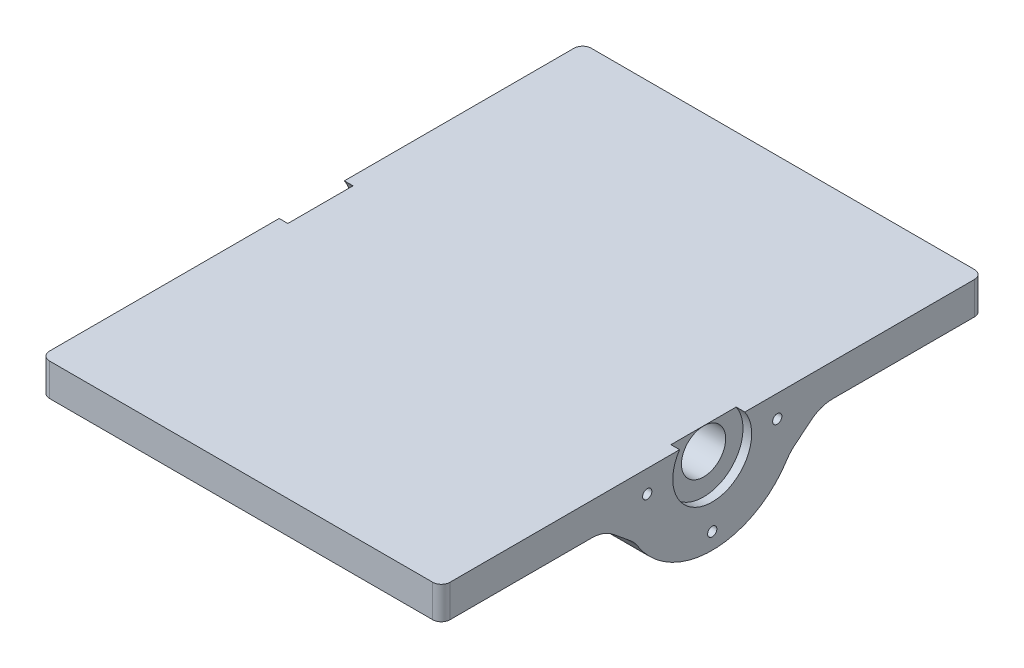
ISO-10303-21;
HEADER;
FILE_DESCRIPTION(('STEP AP214'),'2;1');
FILE_NAME('part.step','',(''),(''),'','','');
FILE_SCHEMA(('AUTOMOTIVE_DESIGN { 1 0 10303 214 1 1 1 1 }'));
ENDSEC;
DATA;
#1=APPLICATION_CONTEXT('core data for automotive mechanical design processes');
#2=APPLICATION_PROTOCOL_DEFINITION('international standard','automotive_design',2000,#1);
#3=PRODUCT_CONTEXT('',#1,'mechanical');
#4=PRODUCT('Part','Part','',(#3));
#5=PRODUCT_RELATED_PRODUCT_CATEGORY('part','',(#4));
#6=PRODUCT_DEFINITION_FORMATION('','',#4);
#7=PRODUCT_DEFINITION_CONTEXT('part definition',#1,'design');
#8=PRODUCT_DEFINITION('design','',#6,#7);
#9=PRODUCT_DEFINITION_SHAPE('','',#8);
#10=(LENGTH_UNIT() NAMED_UNIT(*) SI_UNIT(.MILLI.,.METRE.));
#11=(NAMED_UNIT(*) PLANE_ANGLE_UNIT() SI_UNIT($,.RADIAN.));
#12=(NAMED_UNIT(*) SI_UNIT($,.STERADIAN.) SOLID_ANGLE_UNIT());
#13=UNCERTAINTY_MEASURE_WITH_UNIT(LENGTH_MEASURE(1.E-05),#10,'distance_accuracy_value','');
#14=(GEOMETRIC_REPRESENTATION_CONTEXT(3) GLOBAL_UNCERTAINTY_ASSIGNED_CONTEXT((#13)) GLOBAL_UNIT_ASSIGNED_CONTEXT((#10,
#11,#12)) REPRESENTATION_CONTEXT('',''));
#15=CARTESIAN_POINT('',(0.,0.,0.));
#16=DIRECTION('',(0.,0.,1.));
#17=DIRECTION('',(1.,0.,0.));
#18=AXIS2_PLACEMENT_3D('',#15,#16,#17);
#19=CARTESIAN_POINT('',(-154.686,-6.50240000000002,79.375));
#20=DIRECTION('',(1.,0.,0.));
#21=DIRECTION('',(0.,1.,0.));
#22=AXIS2_PLACEMENT_3D('',#19,#20,#21);
#23=CYLINDRICAL_SURFACE('',#22,6.477);
#24=CARTESIAN_POINT('',(-2.53999999999999,-6.5024,79.375));
#25=DIRECTION('',(1.,0.,0.));
#26=DIRECTION('',(0.,1.,0.));
#27=AXIS2_PLACEMENT_3D('',#24,#25,#26);
#28=CIRCLE('',#27,6.477);
#29=CARTESIAN_POINT('',(-2.53999999999999,-0.0254000000000044,79.375));
#30=VERTEX_POINT('',#29);
#31=EDGE_CURVE('E395',#30,#30,#28,.F.);
#32=ORIENTED_EDGE('',*,*,#31,.F.);
#33=EDGE_LOOP('',(#32));
#34=FACE_BOUND('',#33,.T.);
#35=CARTESIAN_POINT('',(-114.808,-6.50240000000001,79.375));
#36=DIRECTION('',(-1.,0.,0.));
#37=DIRECTION('',(0.,0.,1.));
#38=AXIS2_PLACEMENT_3D('',#35,#36,#37);
#39=CIRCLE('',#38,6.477);
#40=CARTESIAN_POINT('',(-114.808,-6.50240000000001,85.852));
#41=VERTEX_POINT('',#40);
#42=EDGE_CURVE('E199',#41,#41,#39,.F.);
#43=ORIENTED_EDGE('',*,*,#42,.F.);
#44=EDGE_LOOP('',(#43));
#45=FACE_BOUND('',#44,.T.);
#46=ADVANCED_FACE('F50',(#34,#45),#23,.F.);
#47=CARTESIAN_POINT('',(0.,0.,158.75));
#48=DIRECTION('',(0.,-1.,0.));
#49=DIRECTION('',(0.,0.,-1.));
#50=AXIS2_PLACEMENT_3D('',#47,#48,#49);
#51=PLANE('',#50);
#52=DIRECTION('',(-1.,0.,0.));
#53=VECTOR('',#52,1.);
#54=CARTESIAN_POINT('',(0.,0.,158.75));
#55=LINE('',#54,#53);
#56=CARTESIAN_POINT('',(-2.54,0.,158.75));
#57=VERTEX_POINT('',#56);
#58=CARTESIAN_POINT('',(-114.808,0.,158.75));
#59=VERTEX_POINT('',#58);
#60=EDGE_CURVE('E368',#57,#59,#55,.T.);
#61=ORIENTED_EDGE('',*,*,#60,.F.);
#62=CARTESIAN_POINT('',(-2.54,0.,156.21));
#63=DIRECTION('',(0.,-1.,0.));
#64=DIRECTION('',(0.,0.,-1.));
#65=AXIS2_PLACEMENT_3D('',#62,#63,#64);
#66=CIRCLE('',#65,2.54);
#67=CARTESIAN_POINT('',(0.,0.,156.21));
#68=VERTEX_POINT('',#67);
#69=EDGE_CURVE('E317',#57,#68,#66,.F.);
#70=ORIENTED_EDGE('',*,*,#69,.T.);
#71=DIRECTION('',(0.,0.,-1.));
#72=VECTOR('',#71,1.);
#73=CARTESIAN_POINT('',(0.,0.,158.75));
#74=LINE('',#73,#72);
#75=CARTESIAN_POINT('',(0.,0.,88.9292159929531));
#76=VERTEX_POINT('',#75);
#77=EDGE_CURVE('E384',#68,#76,#74,.T.);
#78=ORIENTED_EDGE('',*,*,#77,.T.);
#79=DIRECTION('',(1.,0.,0.));
#80=VECTOR('',#79,1.);
#81=CARTESIAN_POINT('',(-2.54,0.,88.9292159929531));
#82=LINE('',#81,#80);
#83=CARTESIAN_POINT('',(-2.54,0.,88.9292159929531));
#84=VERTEX_POINT('',#83);
#85=EDGE_CURVE('E220',#76,#84,#82,.F.);
#86=ORIENTED_EDGE('',*,*,#85,.T.);
#87=DIRECTION('',(0.,0.,1.));
#88=VECTOR('',#87,1.);
#89=CARTESIAN_POINT('',(-2.54,0.,158.75));
#90=LINE('',#89,#88);
#91=CARTESIAN_POINT('',(-2.54,0.,69.8207840070469));
#92=VERTEX_POINT('',#91);
#93=EDGE_CURVE('E398',#92,#84,#90,.T.);
#94=ORIENTED_EDGE('',*,*,#93,.F.);
#95=DIRECTION('',(1.,0.,0.));
#96=VECTOR('',#95,1.);
#97=CARTESIAN_POINT('',(-2.54,0.,69.8207840070469));
#98=LINE('',#97,#96);
#99=CARTESIAN_POINT('',(0.,0.,69.8207840070469));
#100=VERTEX_POINT('',#99);
#101=EDGE_CURVE('E213',#92,#100,#98,.T.);
#102=ORIENTED_EDGE('',*,*,#101,.T.);
#103=CARTESIAN_POINT('',(0.,0.,2.54000000000004));
#104=VERTEX_POINT('',#103);
#105=EDGE_CURVE('E364',#100,#104,#74,.T.);
#106=ORIENTED_EDGE('',*,*,#105,.T.);
#107=CARTESIAN_POINT('',(-2.54,0.,2.53999999999999));
#108=DIRECTION('',(0.,-1.,0.));
#109=DIRECTION('',(0.,0.,-1.));
#110=AXIS2_PLACEMENT_3D('',#107,#108,#109);
#111=CIRCLE('',#110,2.54);
#112=CARTESIAN_POINT('',(-2.54,0.,0.));
#113=VERTEX_POINT('',#112);
#114=EDGE_CURVE('E308',#104,#113,#111,.F.);
#115=ORIENTED_EDGE('',*,*,#114,.T.);
#116=DIRECTION('',(-1.,0.,0.));
#117=VECTOR('',#116,1.);
#118=CARTESIAN_POINT('',(0.,0.,0.));
#119=LINE('',#118,#117);
#120=CARTESIAN_POINT('',(-114.808,0.,0.));
#121=VERTEX_POINT('',#120);
#122=EDGE_CURVE('E362',#113,#121,#119,.T.);
#123=ORIENTED_EDGE('',*,*,#122,.T.);
#124=CARTESIAN_POINT('',(-114.808,0.,2.53999999999999));
#125=DIRECTION('',(0.,-1.,0.));
#126=DIRECTION('',(0.,0.,-1.));
#127=AXIS2_PLACEMENT_3D('',#124,#125,#126);
#128=CIRCLE('',#127,2.54);
#129=CARTESIAN_POINT('',(-117.348,0.,2.54000000000004));
#130=VERTEX_POINT('',#129);
#131=EDGE_CURVE('E311',#121,#130,#128,.F.);
#132=ORIENTED_EDGE('',*,*,#131,.T.);
#133=DIRECTION('',(0.,0.,-1.));
#134=VECTOR('',#133,1.);
#135=CARTESIAN_POINT('',(-117.348,0.,158.75));
#136=LINE('',#135,#134);
#137=CARTESIAN_POINT('',(-117.348,0.,69.8207840070469));
#138=VERTEX_POINT('',#137);
#139=EDGE_CURVE('E374',#138,#130,#136,.T.);
#140=ORIENTED_EDGE('',*,*,#139,.F.);
#141=DIRECTION('',(-1.,0.,0.));
#142=VECTOR('',#141,1.);
#143=CARTESIAN_POINT('',(-114.808,0.,69.8207840070469));
#144=LINE('',#143,#142);
#145=CARTESIAN_POINT('',(-114.808,0.,69.8207840070469));
#146=VERTEX_POINT('',#145);
#147=EDGE_CURVE('E200',#146,#138,#144,.T.);
#148=ORIENTED_EDGE('',*,*,#147,.F.);
#149=DIRECTION('',(0.,0.,-1.));
#150=VECTOR('',#149,1.);
#151=CARTESIAN_POINT('',(-114.808,0.,158.75));
#152=LINE('',#151,#150);
#153=CARTESIAN_POINT('',(-114.808,0.,88.9292159929531));
#154=VERTEX_POINT('',#153);
#155=EDGE_CURVE('E205',#154,#146,#152,.T.);
#156=ORIENTED_EDGE('',*,*,#155,.F.);
#157=DIRECTION('',(-1.,0.,0.));
#158=VECTOR('',#157,1.);
#159=CARTESIAN_POINT('',(-114.808,0.,88.9292159929531));
#160=LINE('',#159,#158);
#161=CARTESIAN_POINT('',(-117.348,0.,88.9292159929531));
#162=VERTEX_POINT('',#161);
#163=EDGE_CURVE('E188',#162,#154,#160,.F.);
#164=ORIENTED_EDGE('',*,*,#163,.F.);
#165=CARTESIAN_POINT('',(-117.348,0.,156.21));
#166=VERTEX_POINT('',#165);
#167=EDGE_CURVE('E381',#166,#162,#136,.T.);
#168=ORIENTED_EDGE('',*,*,#167,.F.);
#169=CARTESIAN_POINT('',(-114.808,0.,156.21));
#170=DIRECTION('',(0.,-1.,0.));
#171=DIRECTION('',(0.,0.,-1.));
#172=AXIS2_PLACEMENT_3D('',#169,#170,#171);
#173=CIRCLE('',#172,2.54);
#174=EDGE_CURVE('E314',#166,#59,#173,.F.);
#175=ORIENTED_EDGE('',*,*,#174,.T.);
#176=EDGE_LOOP('',(#61,#70,#78,#86,#94,#102,#106,#115,#123,#132,#140,#148,#156,#164,#168,#175));
#177=FACE_BOUND('',#176,.T.);
#178=ADVANCED_FACE('F209',(#177),#51,.F.);
#179=CARTESIAN_POINT('',(0.,0.,158.75));
#180=DIRECTION('',(-1.,0.,0.));
#181=DIRECTION('',(0.,-1.,0.));
#182=AXIS2_PLACEMENT_3D('',#179,#180,#181);
#183=PLANE('',#182);
#184=CARTESIAN_POINT('',(0.,-6.5024,98.425));
#185=DIRECTION('',(1.,0.,0.));
#186=DIRECTION('',(0.,1.,0.));
#187=AXIS2_PLACEMENT_3D('',#184,#185,#186);
#188=CIRCLE('',#187,1.35255);
#189=CARTESIAN_POINT('',(0.,-5.14985,98.425));
#190=VERTEX_POINT('',#189);
#191=EDGE_CURVE('E391',#190,#190,#188,.T.);
#192=ORIENTED_EDGE('',*,*,#191,.F.);
#193=EDGE_LOOP('',(#192));
#194=FACE_BOUND('',#193,.T.);
#195=CARTESIAN_POINT('',(0.,-6.5024,60.325));
#196=DIRECTION('',(1.,0.,0.));
#197=DIRECTION('',(0.,1.,0.));
#198=AXIS2_PLACEMENT_3D('',#195,#196,#197);
#199=CIRCLE('',#198,1.35255);
#200=CARTESIAN_POINT('',(0.,-5.14985,60.325));
#201=VERTEX_POINT('',#200);
#202=EDGE_CURVE('E425',#201,#201,#199,.T.);
#203=ORIENTED_EDGE('',*,*,#202,.F.);
#204=EDGE_LOOP('',(#203));
#205=FACE_BOUND('',#204,.T.);
#206=CARTESIAN_POINT('',(0.,-25.5524,79.375));
#207=DIRECTION('',(1.,0.,0.));
#208=DIRECTION('',(0.,1.,0.));
#209=AXIS2_PLACEMENT_3D('',#206,#207,#208);
#210=CIRCLE('',#209,1.35255);
#211=CARTESIAN_POINT('',(0.,-24.19985,79.375));
#212=VERTEX_POINT('',#211);
#213=EDGE_CURVE('E421',#212,#212,#210,.T.);
#214=ORIENTED_EDGE('',*,*,#213,.F.);
#215=EDGE_LOOP('',(#214));
#216=FACE_BOUND('',#215,.T.);
#217=ORIENTED_EDGE('',*,*,#77,.F.);
#218=DIRECTION('',(0.,1.,0.));
#219=VECTOR('',#218,1.);
#220=CARTESIAN_POINT('',(0.,0.,156.21));
#221=LINE('',#220,#219);
#222=CARTESIAN_POINT('',(0.,-9.525,156.21));
#223=VERTEX_POINT('',#222);
#224=EDGE_CURVE('E324',#68,#223,#221,.F.);
#225=ORIENTED_EDGE('',*,*,#224,.T.);
#226=DIRECTION('',(0.,0.,1.));
#227=VECTOR('',#226,1.);
#228=CARTESIAN_POINT('',(0.,-9.525,158.75));
#229=LINE('',#228,#227);
#230=CARTESIAN_POINT('',(0.,-9.525,114.697404054283));
#231=VERTEX_POINT('',#230);
#232=EDGE_CURVE('E705',#231,#223,#229,.T.);
#233=ORIENTED_EDGE('',*,*,#232,.F.);
#234=CARTESIAN_POINT('',(0.,-19.525,114.697404054283));
#235=DIRECTION('',(-1.,0.,0.));
#236=DIRECTION('',(0.,-1.,0.));
#237=AXIS2_PLACEMENT_3D('',#234,#235,#236);
#238=CIRCLE('',#237,10.);
#239=CARTESIAN_POINT('',(0.,-11.7885396183789,108.36122375669));
#240=VERTEX_POINT('',#239);
#241=EDGE_CURVE('E275',#231,#240,#238,.T.);
#242=ORIENTED_EDGE('',*,*,#241,.T.);
#243=DIRECTION('',(0.,-0.633618029759311,-0.77364603816211));
#244=VECTOR('',#243,1.);
#245=CARTESIAN_POINT('',(0.,17.6446072030277,144.299022808391));
#246=LINE('',#245,#244);
#247=CARTESIAN_POINT('',(0.,-15.8476535429056,103.405055752203));
#248=VERTEX_POINT('',#247);
#249=EDGE_CURVE('E231',#240,#248,#246,.T.);
#250=ORIENTED_EDGE('',*,*,#249,.T.);
#251=CARTESIAN_POINT('',(0.,-23.5841139245267,109.741236049797));
#252=DIRECTION('',(-1.,0.,0.));
#253=DIRECTION('',(0.,-1.,0.));
#254=AXIS2_PLACEMENT_3D('',#251,#252,#253);
#255=CIRCLE('',#254,10.);
#256=CARTESIAN_POINT('',(0.,-18.2470161357175,101.284558972322));
#257=VERTEX_POINT('',#256);
#258=EDGE_CURVE('E284',#248,#257,#255,.T.);
#259=ORIENTED_EDGE('',*,*,#258,.T.);
#260=CARTESIAN_POINT('',(0.,-4.41966318447061,79.375));
#261=DIRECTION('',(-1.,0.,0.));
#262=DIRECTION('',(0.,1.,0.));
#263=AXIS2_PLACEMENT_3D('',#260,#261,#262);
#264=CIRCLE('',#263,25.908);
#265=CARTESIAN_POINT('',(0.,-18.2470161357176,57.4654410276783));
#266=VERTEX_POINT('',#265);
#267=EDGE_CURVE('E359',#266,#257,#264,.T.);
#268=ORIENTED_EDGE('',*,*,#267,.F.);
#269=CARTESIAN_POINT('',(0.,-23.5841139245268,49.0087639502035));
#270=DIRECTION('',(-1.,0.,0.));
#271=DIRECTION('',(0.,-1.,0.));
#272=AXIS2_PLACEMENT_3D('',#269,#270,#271);
#273=CIRCLE('',#272,10.);
#274=CARTESIAN_POINT('',(0.,-15.8476535429056,55.3449442477966));
#275=VERTEX_POINT('',#274);
#276=EDGE_CURVE('E287',#266,#275,#273,.T.);
#277=ORIENTED_EDGE('',*,*,#276,.T.);
#278=DIRECTION('',(0.,0.63361802975931,-0.773646038162111));
#279=VECTOR('',#278,1.);
#280=CARTESIAN_POINT('',(0.,-60.1740202479527,109.467327729383));
#281=LINE('',#280,#279);
#282=CARTESIAN_POINT('',(0.,-11.7885396183789,50.3887762433102));
#283=VERTEX_POINT('',#282);
#284=EDGE_CURVE('E239',#275,#283,#281,.T.);
#285=ORIENTED_EDGE('',*,*,#284,.T.);
#286=CARTESIAN_POINT('',(0.,-19.525,44.0525959457171));
#287=DIRECTION('',(-1.,0.,0.));
#288=DIRECTION('',(0.,-1.,0.));
#289=AXIS2_PLACEMENT_3D('',#286,#287,#288);
#290=CIRCLE('',#289,10.);
#291=CARTESIAN_POINT('',(0.,-9.525,44.0525959457171));
#292=VERTEX_POINT('',#291);
#293=EDGE_CURVE('E296',#283,#292,#290,.T.);
#294=ORIENTED_EDGE('',*,*,#293,.T.);
#295=DIRECTION('',(0.,0.,1.));
#296=VECTOR('',#295,1.);
#297=CARTESIAN_POINT('',(0.,-9.525,53.975));
#298=LINE('',#297,#296);
#299=CARTESIAN_POINT('',(0.,-9.525,2.53999999999999));
#300=VERTEX_POINT('',#299);
#301=EDGE_CURVE('E348',#300,#292,#298,.T.);
#302=ORIENTED_EDGE('',*,*,#301,.F.);
#303=DIRECTION('',(0.,1.,0.));
#304=VECTOR('',#303,1.);
#305=CARTESIAN_POINT('',(0.,0.,2.53999999999999));
#306=LINE('',#305,#304);
#307=EDGE_CURVE('E320',#300,#104,#306,.T.);
#308=ORIENTED_EDGE('',*,*,#307,.T.);
#309=ORIENTED_EDGE('',*,*,#105,.F.);
#310=CARTESIAN_POINT('',(0.,-6.5024,79.375));
#311=DIRECTION('',(1.,0.,0.));
#312=DIRECTION('',(0.,1.,0.));
#313=AXIS2_PLACEMENT_3D('',#310,#311,#312);
#314=CIRCLE('',#313,11.557);
#315=EDGE_CURVE('E409',#76,#100,#314,.T.);
#316=ORIENTED_EDGE('',*,*,#315,.F.);
#317=EDGE_LOOP('',(#217,#225,#233,#242,#250,#259,#268,#277,#285,#294,#302,#308,#309,#316));
#318=FACE_BOUND('',#317,.T.);
#319=ADVANCED_FACE('F353',(#194,#205,#216,#318),#183,.F.);
#320=CARTESIAN_POINT('',(-117.348,0.,158.75));
#321=DIRECTION('',(1.,0.,0.));
#322=DIRECTION('',(0.,0.,-1.));
#323=AXIS2_PLACEMENT_3D('',#320,#321,#322);
#324=PLANE('',#323);
#325=DIRECTION('',(0.,0.,1.));
#326=VECTOR('',#325,1.);
#327=CARTESIAN_POINT('',(-117.348,-9.52500000000001,158.75));
#328=LINE('',#327,#326);
#329=CARTESIAN_POINT('',(-117.348,-9.52500000000001,114.697404054283));
#330=VERTEX_POINT('',#329);
#331=CARTESIAN_POINT('',(-117.348,-9.52500000000001,156.21));
#332=VERTEX_POINT('',#331);
#333=EDGE_CURVE('E695',#330,#332,#328,.T.);
#334=ORIENTED_EDGE('',*,*,#333,.T.);
#335=DIRECTION('',(0.,-1.,0.));
#336=VECTOR('',#335,1.);
#337=CARTESIAN_POINT('',(-117.348,0.,156.21));
#338=LINE('',#337,#336);
#339=EDGE_CURVE('E337',#332,#166,#338,.F.);
#340=ORIENTED_EDGE('',*,*,#339,.T.);
#341=ORIENTED_EDGE('',*,*,#167,.T.);
#342=CARTESIAN_POINT('',(-117.348,-6.50240000000001,79.375));
#343=DIRECTION('',(1.,0.,0.));
#344=DIRECTION('',(0.,1.,0.));
#345=AXIS2_PLACEMENT_3D('',#342,#343,#344);
#346=CIRCLE('',#345,11.557);
#347=EDGE_CURVE('E194',#162,#138,#346,.T.);
#348=ORIENTED_EDGE('',*,*,#347,.T.);
#349=ORIENTED_EDGE('',*,*,#139,.T.);
#350=DIRECTION('',(0.,-1.,0.));
#351=VECTOR('',#350,1.);
#352=CARTESIAN_POINT('',(-117.348,-9.52500000000001,2.53999999999999));
#353=LINE('',#352,#351);
#354=CARTESIAN_POINT('',(-117.348,-9.52500000000001,2.53999999999999));
#355=VERTEX_POINT('',#354);
#356=EDGE_CURVE('E333',#130,#355,#353,.T.);
#357=ORIENTED_EDGE('',*,*,#356,.T.);
#358=DIRECTION('',(0.,0.,1.));
#359=VECTOR('',#358,1.);
#360=CARTESIAN_POINT('',(-117.348,-9.52500000000002,158.75));
#361=LINE('',#360,#359);
#362=CARTESIAN_POINT('',(-117.348,-9.52500000000001,44.0525959457171));
#363=VERTEX_POINT('',#362);
#364=EDGE_CURVE('E698',#355,#363,#361,.T.);
#365=ORIENTED_EDGE('',*,*,#364,.T.);
#366=CARTESIAN_POINT('',(-117.348,-19.525,44.0525959457171));
#367=DIRECTION('',(1.,0.,0.));
#368=DIRECTION('',(0.,0.,-1.));
#369=AXIS2_PLACEMENT_3D('',#366,#367,#368);
#370=CIRCLE('',#369,10.);
#371=CARTESIAN_POINT('',(-117.348,-11.7885396183789,50.3887762433102));
#372=VERTEX_POINT('',#371);
#373=EDGE_CURVE('E293',#363,#372,#370,.T.);
#374=ORIENTED_EDGE('',*,*,#373,.T.);
#375=DIRECTION('',(0.,-0.63361802975931,0.773646038162111));
#376=VECTOR('',#375,1.);
#377=CARTESIAN_POINT('',(-117.348,-60.1740202479527,109.467327729383));
#378=LINE('',#377,#376);
#379=CARTESIAN_POINT('',(-117.348,-15.8476535429057,55.3449442477966));
#380=VERTEX_POINT('',#379);
#381=EDGE_CURVE('E243',#372,#380,#378,.T.);
#382=ORIENTED_EDGE('',*,*,#381,.T.);
#383=CARTESIAN_POINT('',(-117.348,-23.5841139245268,49.0087639502035));
#384=DIRECTION('',(1.,0.,0.));
#385=DIRECTION('',(0.,0.,-1.));
#386=AXIS2_PLACEMENT_3D('',#383,#384,#385);
#387=CIRCLE('',#386,10.);
#388=CARTESIAN_POINT('',(-117.348,-18.2470161357176,57.4654410276783));
#389=VERTEX_POINT('',#388);
#390=EDGE_CURVE('E290',#380,#389,#387,.T.);
#391=ORIENTED_EDGE('',*,*,#390,.T.);
#392=CARTESIAN_POINT('',(-117.348,-4.41966318447063,79.375));
#393=DIRECTION('',(1.,0.,0.));
#394=DIRECTION('',(0.,0.,-1.));
#395=AXIS2_PLACEMENT_3D('',#392,#393,#394);
#396=CIRCLE('',#395,25.908);
#397=CARTESIAN_POINT('',(-117.348,-18.2470161357175,101.284558972322));
#398=VERTEX_POINT('',#397);
#399=EDGE_CURVE('E227',#389,#398,#396,.F.);
#400=ORIENTED_EDGE('',*,*,#399,.T.);
#401=CARTESIAN_POINT('',(-117.348,-23.5841139245267,109.741236049797));
#402=DIRECTION('',(1.,0.,0.));
#403=DIRECTION('',(0.,0.,-1.));
#404=AXIS2_PLACEMENT_3D('',#401,#402,#403);
#405=CIRCLE('',#404,10.);
#406=CARTESIAN_POINT('',(-117.348,-15.8476535429056,103.405055752203));
#407=VERTEX_POINT('',#406);
#408=EDGE_CURVE('E281',#398,#407,#405,.T.);
#409=ORIENTED_EDGE('',*,*,#408,.T.);
#410=DIRECTION('',(0.,0.633618029759311,0.77364603816211));
#411=VECTOR('',#410,1.);
#412=CARTESIAN_POINT('',(-117.348,17.6446072030277,144.299022808391));
#413=LINE('',#412,#411);
#414=CARTESIAN_POINT('',(-117.348,-11.7885396183789,108.36122375669));
#415=VERTEX_POINT('',#414);
#416=EDGE_CURVE('E235',#407,#415,#413,.T.);
#417=ORIENTED_EDGE('',*,*,#416,.T.);
#418=CARTESIAN_POINT('',(-117.348,-19.525,114.697404054283));
#419=DIRECTION('',(1.,0.,0.));
#420=DIRECTION('',(0.,0.,-1.));
#421=AXIS2_PLACEMENT_3D('',#418,#419,#420);
#422=CIRCLE('',#421,10.);
#423=EDGE_CURVE('E278',#415,#330,#422,.T.);
#424=ORIENTED_EDGE('',*,*,#423,.T.);
#425=EDGE_LOOP('',(#334,#340,#341,#348,#349,#357,#365,#374,#382,#391,#400,#409,#417,#424));
#426=FACE_BOUND('',#425,.T.);
#427=CARTESIAN_POINT('',(-117.348,-6.50240000000002,98.425));
#428=DIRECTION('',(1.,0.,0.));
#429=DIRECTION('',(0.,0.,-1.));
#430=AXIS2_PLACEMENT_3D('',#427,#428,#429);
#431=CIRCLE('',#430,1.35255);
#432=CARTESIAN_POINT('',(-117.348,-5.14985000000002,98.425));
#433=VERTEX_POINT('',#432);
#434=EDGE_CURVE('E369',#433,#433,#431,.T.);
#435=ORIENTED_EDGE('',*,*,#434,.T.);
#436=EDGE_LOOP('',(#435));
#437=FACE_BOUND('',#436,.T.);
#438=CARTESIAN_POINT('',(-117.348,-6.50240000000001,60.325));
#439=DIRECTION('',(1.,0.,0.));
#440=DIRECTION('',(0.,0.,-1.));
#441=AXIS2_PLACEMENT_3D('',#438,#439,#440);
#442=CIRCLE('',#441,1.35255);
#443=CARTESIAN_POINT('',(-117.348,-5.14985000000001,60.325));
#444=VERTEX_POINT('',#443);
#445=EDGE_CURVE('E377',#444,#444,#442,.T.);
#446=ORIENTED_EDGE('',*,*,#445,.T.);
#447=EDGE_LOOP('',(#446));
#448=FACE_BOUND('',#447,.T.);
#449=CARTESIAN_POINT('',(-117.348,-25.5524,79.375));
#450=DIRECTION('',(1.,0.,0.));
#451=DIRECTION('',(0.,0.,-1.));
#452=AXIS2_PLACEMENT_3D('',#449,#450,#451);
#453=CIRCLE('',#452,1.35255);
#454=CARTESIAN_POINT('',(-117.348,-24.19985,79.375));
#455=VERTEX_POINT('',#454);
#456=EDGE_CURVE('E387',#455,#455,#453,.T.);
#457=ORIENTED_EDGE('',*,*,#456,.T.);
#458=EDGE_LOOP('',(#457));
#459=FACE_BOUND('',#458,.T.);
#460=ADVANCED_FACE('F436',(#426,#437,#448,#459),#324,.F.);
#461=CARTESIAN_POINT('',(0.,0.,158.75));
#462=DIRECTION('',(0.,0.,-1.));
#463=DIRECTION('',(-1.,0.,0.));
#464=AXIS2_PLACEMENT_3D('',#461,#462,#463);
#465=PLANE('',#464);
#466=DIRECTION('',(1.,0.,0.));
#467=VECTOR('',#466,1.);
#468=CARTESIAN_POINT('',(0.,-9.525,158.75));
#469=LINE('',#468,#467);
#470=CARTESIAN_POINT('',(-114.808,-9.52500000000001,158.75));
#471=VERTEX_POINT('',#470);
#472=CARTESIAN_POINT('',(-2.54,-9.525,158.75));
#473=VERTEX_POINT('',#472);
#474=EDGE_CURVE('E217',#471,#473,#469,.T.);
#475=ORIENTED_EDGE('',*,*,#474,.T.);
#476=DIRECTION('',(0.,1.,0.));
#477=VECTOR('',#476,1.);
#478=CARTESIAN_POINT('',(-2.54,0.,158.75));
#479=LINE('',#478,#477);
#480=EDGE_CURVE('E304',#473,#57,#479,.T.);
#481=ORIENTED_EDGE('',*,*,#480,.T.);
#482=ORIENTED_EDGE('',*,*,#60,.T.);
#483=DIRECTION('',(0.,-1.,0.));
#484=VECTOR('',#483,1.);
#485=CARTESIAN_POINT('',(-114.808,0.,158.75));
#486=LINE('',#485,#484);
#487=EDGE_CURVE('E300',#59,#471,#486,.T.);
#488=ORIENTED_EDGE('',*,*,#487,.T.);
#489=EDGE_LOOP('',(#475,#481,#482,#488));
#490=FACE_BOUND('',#489,.T.);
#491=ADVANCED_FACE('F443',(#490),#465,.F.);
#492=CARTESIAN_POINT('',(0.,0.,0.));
#493=DIRECTION('',(0.,0.,-1.));
#494=DIRECTION('',(-1.,0.,0.));
#495=AXIS2_PLACEMENT_3D('',#492,#493,#494);
#496=PLANE('',#495);
#497=DIRECTION('',(1.,0.,0.));
#498=VECTOR('',#497,1.);
#499=CARTESIAN_POINT('',(0.,-9.525,0.));
#500=LINE('',#499,#498);
#501=CARTESIAN_POINT('',(-114.808,-9.52500000000001,0.));
#502=VERTEX_POINT('',#501);
#503=CARTESIAN_POINT('',(-2.54,-9.525,0.));
#504=VERTEX_POINT('',#503);
#505=EDGE_CURVE('E212',#502,#504,#500,.T.);
#506=ORIENTED_EDGE('',*,*,#505,.F.);
#507=DIRECTION('',(0.,-1.,0.));
#508=VECTOR('',#507,1.);
#509=CARTESIAN_POINT('',(-114.808,0.,0.));
#510=LINE('',#509,#508);
#511=EDGE_CURVE('E12',#502,#121,#510,.F.);
#512=ORIENTED_EDGE('',*,*,#511,.T.);
#513=ORIENTED_EDGE('',*,*,#122,.F.);
#514=DIRECTION('',(0.,1.,0.));
#515=VECTOR('',#514,1.);
#516=CARTESIAN_POINT('',(-2.54,-9.525,0.));
#517=LINE('',#516,#515);
#518=EDGE_CURVE('E59',#113,#504,#517,.F.);
#519=ORIENTED_EDGE('',*,*,#518,.T.);
#520=EDGE_LOOP('',(#506,#512,#513,#519));
#521=FACE_BOUND('',#520,.T.);
#522=ADVANCED_FACE('F365',(#521),#496,.T.);
#523=CARTESIAN_POINT('',(-152.4,-25.5524,79.375));
#524=DIRECTION('',(1.,0.,0.));
#525=DIRECTION('',(0.,1.,0.));
#526=AXIS2_PLACEMENT_3D('',#523,#524,#525);
#527=CYLINDRICAL_SURFACE('',#526,1.35255);
#528=CARTESIAN_POINT('',(0.,-24.19985,79.375));
#529=CARTESIAN_POINT('',(-1.222375,-24.19985,79.375));
#530=CARTESIAN_POINT('',(-2.44475,-24.19985,79.375));
#531=CARTESIAN_POINT('',(-4.8895,-24.19985,79.375));
#532=CARTESIAN_POINT('',(-6.11187500000001,-24.19985,79.375));
#533=CARTESIAN_POINT('',(-8.55662500000001,-24.19985,79.375));
#534=CARTESIAN_POINT('',(-9.77900000000001,-24.19985,79.375));
#535=CARTESIAN_POINT('',(-12.22375,-24.19985,79.375));
#536=CARTESIAN_POINT('',(-13.446125,-24.19985,79.375));
#537=CARTESIAN_POINT('',(-15.890875,-24.19985,79.375));
#538=CARTESIAN_POINT('',(-17.11325,-24.19985,79.375));
#539=CARTESIAN_POINT('',(-19.558,-24.19985,79.375));
#540=CARTESIAN_POINT('',(-20.780375,-24.19985,79.375));
#541=CARTESIAN_POINT('',(-23.225125,-24.19985,79.375));
#542=CARTESIAN_POINT('',(-24.4475,-24.19985,79.375));
#543=CARTESIAN_POINT('',(-26.89225,-24.19985,79.375));
#544=CARTESIAN_POINT('',(-28.114625,-24.19985,79.375));
#545=CARTESIAN_POINT('',(-30.559375,-24.19985,79.375));
#546=CARTESIAN_POINT('',(-31.78175,-24.19985,79.375));
#547=CARTESIAN_POINT('',(-34.2265,-24.19985,79.375));
#548=CARTESIAN_POINT('',(-35.448875,-24.19985,79.375));
#549=CARTESIAN_POINT('',(-37.893625,-24.19985,79.375));
#550=CARTESIAN_POINT('',(-39.116,-24.19985,79.375));
#551=CARTESIAN_POINT('',(-41.56075,-24.19985,79.375));
#552=CARTESIAN_POINT('',(-42.783125,-24.19985,79.375));
#553=CARTESIAN_POINT('',(-45.227875,-24.19985,79.375));
#554=CARTESIAN_POINT('',(-46.45025,-24.19985,79.375));
#555=CARTESIAN_POINT('',(-48.895,-24.19985,79.375));
#556=CARTESIAN_POINT('',(-50.117375,-24.19985,79.375));
#557=CARTESIAN_POINT('',(-52.562125,-24.19985,79.375));
#558=CARTESIAN_POINT('',(-53.7845,-24.19985,79.375));
#559=CARTESIAN_POINT('',(-56.22925,-24.19985,79.375));
#560=CARTESIAN_POINT('',(-57.451625,-24.19985,79.375));
#561=CARTESIAN_POINT('',(-59.896375,-24.19985,79.375));
#562=CARTESIAN_POINT('',(-61.11875,-24.19985,79.375));
#563=CARTESIAN_POINT('',(-63.5635,-24.19985,79.375));
#564=CARTESIAN_POINT('',(-64.785875,-24.19985,79.375));
#565=CARTESIAN_POINT('',(-67.230625,-24.19985,79.375));
#566=CARTESIAN_POINT('',(-68.453,-24.19985,79.375));
#567=CARTESIAN_POINT('',(-70.89775,-24.19985,79.375));
#568=CARTESIAN_POINT('',(-72.120125,-24.19985,79.375));
#569=CARTESIAN_POINT('',(-74.564875,-24.19985,79.375));
#570=CARTESIAN_POINT('',(-75.78725,-24.19985,79.375));
#571=CARTESIAN_POINT('',(-78.232,-24.19985,79.375));
#572=CARTESIAN_POINT('',(-79.454375,-24.19985,79.375));
#573=CARTESIAN_POINT('',(-81.899125,-24.19985,79.375));
#574=CARTESIAN_POINT('',(-83.1215,-24.19985,79.375));
#575=CARTESIAN_POINT('',(-85.56625,-24.19985,79.375));
#576=CARTESIAN_POINT('',(-86.788625,-24.19985,79.375));
#577=CARTESIAN_POINT('',(-89.233375,-24.19985,79.375));
#578=CARTESIAN_POINT('',(-90.45575,-24.19985,79.375));
#579=CARTESIAN_POINT('',(-92.9005,-24.19985,79.375));
#580=CARTESIAN_POINT('',(-94.122875,-24.19985,79.375));
#581=CARTESIAN_POINT('',(-96.567625,-24.19985,79.375));
#582=CARTESIAN_POINT('',(-97.79,-24.19985,79.375));
#583=CARTESIAN_POINT('',(-100.23475,-24.19985,79.375));
#584=CARTESIAN_POINT('',(-101.457125,-24.19985,79.375));
#585=CARTESIAN_POINT('',(-103.901875,-24.19985,79.375));
#586=CARTESIAN_POINT('',(-105.12425,-24.19985,79.375));
#587=CARTESIAN_POINT('',(-107.569,-24.19985,79.375));
#588=CARTESIAN_POINT('',(-108.791375,-24.19985,79.375));
#589=CARTESIAN_POINT('',(-111.236125,-24.19985,79.375));
#590=CARTESIAN_POINT('',(-112.4585,-24.19985,79.375));
#591=CARTESIAN_POINT('',(-114.90325,-24.19985,79.375));
#592=CARTESIAN_POINT('',(-116.125625,-24.19985,79.375));
#593=CARTESIAN_POINT('',(-117.348,-24.19985,79.375));
#594=B_SPLINE_CURVE_WITH_KNOTS('',3,(#528,#529,#530,#531,#532,#533,#534,#535,#536,#537,#538,
#539,#540,#541,#542,#543,#544,#545,#546,#547,#548,#549,#550,#551,#552,#553,#554,#555,#556,#557,
#558,#559,#560,#561,#562,#563,#564,#565,#566,#567,#568,#569,#570,#571,#572,#573,#574,#575,#576,
#577,#578,#579,#580,#581,#582,#583,#584,#585,#586,#587,#588,#589,#590,#591,#592,#593),
.UNSPECIFIED.,.F.,.F.,(4,2,2,2,2,2,2,2,2,2,2,2,2,2,2,2,2,2,2,2,2,2,2,2,2,2,2,2,2,2,2,2,4),(0.,
3.66712499999999,7.33425000000001,11.001375,14.6685,18.335625,22.00275,25.669875,29.337,
33.004125,36.67125,40.338375,44.0055,47.672625,51.33975,55.006875,58.674,62.341125,66.00825,
69.675375,73.3425,77.009625,80.67675,84.343875,88.011,91.678125,95.34525,99.012375,102.6795,
106.346625,110.01375,113.680875,117.348),.UNSPECIFIED.);
#595=EDGE_CURVE('BSEAM432',#212,#455,#594,.T.);
#596=ORIENTED_EDGE('',*,*,#213,.T.);
#597=ORIENTED_EDGE('',*,*,#456,.F.);
#598=ORIENTED_EDGE('',*,*,#595,.T.);
#599=ORIENTED_EDGE('',*,*,#595,.F.);
#600=EDGE_LOOP('',(#596,#598,#597,#599));
#601=FACE_BOUND('',#600,.T.);
#602=ADVANCED_FACE('F432',(#601),#527,.F.);
#603=CARTESIAN_POINT('',(-152.4,-6.50240000000002,60.325));
#604=DIRECTION('',(1.,0.,0.));
#605=DIRECTION('',(0.,1.,0.));
#606=AXIS2_PLACEMENT_3D('',#603,#604,#605);
#607=CYLINDRICAL_SURFACE('',#606,1.35255);
#608=CARTESIAN_POINT('',(0.,-5.14985,60.325));
#609=CARTESIAN_POINT('',(-1.222375,-5.14985,60.325));
#610=CARTESIAN_POINT('',(-2.44475,-5.14985,60.325));
#611=CARTESIAN_POINT('',(-4.8895,-5.14985,60.325));
#612=CARTESIAN_POINT('',(-6.11187500000001,-5.14985,60.325));
#613=CARTESIAN_POINT('',(-8.55662500000001,-5.14985,60.325));
#614=CARTESIAN_POINT('',(-9.77900000000001,-5.14985,60.325));
#615=CARTESIAN_POINT('',(-12.22375,-5.14985,60.325));
#616=CARTESIAN_POINT('',(-13.446125,-5.14985,60.325));
#617=CARTESIAN_POINT('',(-15.890875,-5.14985,60.325));
#618=CARTESIAN_POINT('',(-17.11325,-5.14985,60.325));
#619=CARTESIAN_POINT('',(-19.558,-5.14985,60.325));
#620=CARTESIAN_POINT('',(-20.780375,-5.14985,60.325));
#621=CARTESIAN_POINT('',(-23.225125,-5.14985,60.325));
#622=CARTESIAN_POINT('',(-24.4475,-5.14985,60.325));
#623=CARTESIAN_POINT('',(-26.89225,-5.14985,60.325));
#624=CARTESIAN_POINT('',(-28.114625,-5.14985,60.325));
#625=CARTESIAN_POINT('',(-30.559375,-5.14985,60.325));
#626=CARTESIAN_POINT('',(-31.78175,-5.14985,60.325));
#627=CARTESIAN_POINT('',(-34.2265,-5.14985,60.325));
#628=CARTESIAN_POINT('',(-35.448875,-5.14985,60.325));
#629=CARTESIAN_POINT('',(-37.893625,-5.14985,60.325));
#630=CARTESIAN_POINT('',(-39.116,-5.14985,60.325));
#631=CARTESIAN_POINT('',(-41.56075,-5.14985,60.325));
#632=CARTESIAN_POINT('',(-42.783125,-5.14985000000001,60.325));
#633=CARTESIAN_POINT('',(-45.227875,-5.14985000000001,60.325));
#634=CARTESIAN_POINT('',(-46.45025,-5.14985000000001,60.325));
#635=CARTESIAN_POINT('',(-48.895,-5.14985000000001,60.325));
#636=CARTESIAN_POINT('',(-50.117375,-5.14985000000001,60.325));
#637=CARTESIAN_POINT('',(-52.562125,-5.14985000000001,60.325));
#638=CARTESIAN_POINT('',(-53.7845,-5.14985000000001,60.325));
#639=CARTESIAN_POINT('',(-56.22925,-5.14985000000001,60.325));
#640=CARTESIAN_POINT('',(-57.451625,-5.14985000000001,60.325));
#641=CARTESIAN_POINT('',(-59.896375,-5.14985000000001,60.325));
#642=CARTESIAN_POINT('',(-61.11875,-5.14985000000001,60.325));
#643=CARTESIAN_POINT('',(-63.5635,-5.14985000000001,60.325));
#644=CARTESIAN_POINT('',(-64.785875,-5.14985000000001,60.325));
#645=CARTESIAN_POINT('',(-67.230625,-5.14985000000001,60.325));
#646=CARTESIAN_POINT('',(-68.453,-5.14985000000001,60.325));
#647=CARTESIAN_POINT('',(-70.89775,-5.14985000000001,60.325));
#648=CARTESIAN_POINT('',(-72.120125,-5.14985000000001,60.325));
#649=CARTESIAN_POINT('',(-74.564875,-5.14985000000001,60.325));
#650=CARTESIAN_POINT('',(-75.78725,-5.14985000000001,60.325));
#651=CARTESIAN_POINT('',(-78.232,-5.14985000000001,60.325));
#652=CARTESIAN_POINT('',(-79.454375,-5.14985000000001,60.325));
#653=CARTESIAN_POINT('',(-81.899125,-5.14985000000001,60.325));
#654=CARTESIAN_POINT('',(-83.1215,-5.14985000000001,60.325));
#655=CARTESIAN_POINT('',(-85.56625,-5.14985000000001,60.325));
#656=CARTESIAN_POINT('',(-86.788625,-5.14985000000001,60.325));
#657=CARTESIAN_POINT('',(-89.233375,-5.14985000000001,60.325));
#658=CARTESIAN_POINT('',(-90.45575,-5.14985000000001,60.325));
#659=CARTESIAN_POINT('',(-92.9005,-5.14985000000001,60.325));
#660=CARTESIAN_POINT('',(-94.122875,-5.14985000000001,60.325));
#661=CARTESIAN_POINT('',(-96.567625,-5.14985000000001,60.325));
#662=CARTESIAN_POINT('',(-97.79,-5.14985000000001,60.325));
#663=CARTESIAN_POINT('',(-100.23475,-5.14985000000001,60.325));
#664=CARTESIAN_POINT('',(-101.457125,-5.14985000000001,60.325));
#665=CARTESIAN_POINT('',(-103.901875,-5.14985000000001,60.325));
#666=CARTESIAN_POINT('',(-105.12425,-5.14985000000001,60.325));
#667=CARTESIAN_POINT('',(-107.569,-5.14985000000001,60.325));
#668=CARTESIAN_POINT('',(-108.791375,-5.14985000000001,60.325));
#669=CARTESIAN_POINT('',(-111.236125,-5.14985000000001,60.325));
#670=CARTESIAN_POINT('',(-112.4585,-5.14985000000001,60.325));
#671=CARTESIAN_POINT('',(-114.90325,-5.14985000000001,60.325));
#672=CARTESIAN_POINT('',(-116.125625,-5.14985000000001,60.325));
#673=CARTESIAN_POINT('',(-117.348,-5.14985000000001,60.325));
#674=B_SPLINE_CURVE_WITH_KNOTS('',3,(#608,#609,#610,#611,#612,#613,#614,#615,#616,#617,#618,
#619,#620,#621,#622,#623,#624,#625,#626,#627,#628,#629,#630,#631,#632,#633,#634,#635,#636,#637,
#638,#639,#640,#641,#642,#643,#644,#645,#646,#647,#648,#649,#650,#651,#652,#653,#654,#655,#656,
#657,#658,#659,#660,#661,#662,#663,#664,#665,#666,#667,#668,#669,#670,#671,#672,#673),
.UNSPECIFIED.,.F.,.F.,(4,2,2,2,2,2,2,2,2,2,2,2,2,2,2,2,2,2,2,2,2,2,2,2,2,2,2,2,2,2,2,2,4),(0.,
3.66712499999999,7.33425000000001,11.001375,14.6685,18.335625,22.00275,25.669875,29.337,
33.004125,36.67125,40.338375,44.0055,47.672625,51.33975,55.006875,58.674,62.341125,66.00825,
69.675375,73.3425,77.009625,80.67675,84.343875,88.011,91.678125,95.34525,99.012375,102.6795,
106.346625,110.01375,113.680875,117.348),.UNSPECIFIED.);
#675=EDGE_CURVE('BSEAM463',#201,#444,#674,.T.);
#676=ORIENTED_EDGE('',*,*,#202,.T.);
#677=ORIENTED_EDGE('',*,*,#445,.F.);
#678=ORIENTED_EDGE('',*,*,#675,.T.);
#679=ORIENTED_EDGE('',*,*,#675,.F.);
#680=EDGE_LOOP('',(#676,#678,#677,#679));
#681=FACE_BOUND('',#680,.T.);
#682=ADVANCED_FACE('F463',(#681),#607,.F.);
#683=CARTESIAN_POINT('',(-152.4,-6.50240000000002,98.425));
#684=DIRECTION('',(1.,0.,0.));
#685=DIRECTION('',(0.,1.,0.));
#686=AXIS2_PLACEMENT_3D('',#683,#684,#685);
#687=CYLINDRICAL_SURFACE('',#686,1.35255);
#688=CARTESIAN_POINT('',(0.,-5.14985,98.425));
#689=CARTESIAN_POINT('',(-1.222375,-5.14985,98.425));
#690=CARTESIAN_POINT('',(-2.44475,-5.14985,98.425));
#691=CARTESIAN_POINT('',(-4.8895,-5.14985,98.425));
#692=CARTESIAN_POINT('',(-6.11187500000001,-5.14985,98.425));
#693=CARTESIAN_POINT('',(-8.55662500000001,-5.14985,98.425));
#694=CARTESIAN_POINT('',(-9.77900000000001,-5.14985,98.425));
#695=CARTESIAN_POINT('',(-12.22375,-5.14985,98.425));
#696=CARTESIAN_POINT('',(-13.446125,-5.14985000000001,98.425));
#697=CARTESIAN_POINT('',(-15.890875,-5.14985000000001,98.425));
#698=CARTESIAN_POINT('',(-17.11325,-5.14985000000001,98.425));
#699=CARTESIAN_POINT('',(-19.558,-5.14985000000001,98.425));
#700=CARTESIAN_POINT('',(-20.780375,-5.14985000000001,98.425));
#701=CARTESIAN_POINT('',(-23.225125,-5.14985000000001,98.425));
#702=CARTESIAN_POINT('',(-24.4475,-5.14985000000001,98.425));
#703=CARTESIAN_POINT('',(-26.89225,-5.14985000000001,98.425));
#704=CARTESIAN_POINT('',(-28.114625,-5.14985000000001,98.425));
#705=CARTESIAN_POINT('',(-30.559375,-5.14985000000001,98.425));
#706=CARTESIAN_POINT('',(-31.78175,-5.14985000000001,98.425));
#707=CARTESIAN_POINT('',(-34.2265,-5.14985000000001,98.425));
#708=CARTESIAN_POINT('',(-35.448875,-5.14985000000001,98.425));
#709=CARTESIAN_POINT('',(-37.893625,-5.14985000000001,98.425));
#710=CARTESIAN_POINT('',(-39.116,-5.14985000000001,98.425));
#711=CARTESIAN_POINT('',(-41.56075,-5.14985000000001,98.425));
#712=CARTESIAN_POINT('',(-42.783125,-5.14985000000001,98.425));
#713=CARTESIAN_POINT('',(-45.227875,-5.14985000000001,98.425));
#714=CARTESIAN_POINT('',(-46.45025,-5.14985000000001,98.425));
#715=CARTESIAN_POINT('',(-48.895,-5.14985000000001,98.425));
#716=CARTESIAN_POINT('',(-50.117375,-5.14985000000001,98.425));
#717=CARTESIAN_POINT('',(-52.562125,-5.14985000000001,98.425));
#718=CARTESIAN_POINT('',(-53.7845,-5.14985000000001,98.425));
#719=CARTESIAN_POINT('',(-56.22925,-5.14985000000001,98.425));
#720=CARTESIAN_POINT('',(-57.451625,-5.14985000000001,98.425));
#721=CARTESIAN_POINT('',(-59.896375,-5.14985000000001,98.425));
#722=CARTESIAN_POINT('',(-61.11875,-5.14985000000001,98.425));
#723=CARTESIAN_POINT('',(-63.5635,-5.14985000000001,98.425));
#724=CARTESIAN_POINT('',(-64.785875,-5.14985000000001,98.425));
#725=CARTESIAN_POINT('',(-67.230625,-5.14985000000001,98.425));
#726=CARTESIAN_POINT('',(-68.453,-5.14985000000001,98.425));
#727=CARTESIAN_POINT('',(-70.89775,-5.14985000000001,98.425));
#728=CARTESIAN_POINT('',(-72.120125,-5.14985000000001,98.425));
#729=CARTESIAN_POINT('',(-74.564875,-5.14985000000001,98.425));
#730=CARTESIAN_POINT('',(-75.78725,-5.14985000000001,98.425));
#731=CARTESIAN_POINT('',(-78.232,-5.14985000000001,98.425));
#732=CARTESIAN_POINT('',(-79.454375,-5.14985000000001,98.425));
#733=CARTESIAN_POINT('',(-81.899125,-5.14985000000001,98.425));
#734=CARTESIAN_POINT('',(-83.1215,-5.14985000000001,98.425));
#735=CARTESIAN_POINT('',(-85.56625,-5.14985000000001,98.425));
#736=CARTESIAN_POINT('',(-86.788625,-5.14985000000001,98.425));
#737=CARTESIAN_POINT('',(-89.233375,-5.14985000000001,98.425));
#738=CARTESIAN_POINT('',(-90.45575,-5.14985000000001,98.425));
#739=CARTESIAN_POINT('',(-92.9005,-5.14985000000001,98.425));
#740=CARTESIAN_POINT('',(-94.122875,-5.14985000000001,98.425));
#741=CARTESIAN_POINT('',(-96.567625,-5.14985000000001,98.425));
#742=CARTESIAN_POINT('',(-97.79,-5.14985000000001,98.425));
#743=CARTESIAN_POINT('',(-100.23475,-5.14985000000001,98.425));
#744=CARTESIAN_POINT('',(-101.457125,-5.14985000000002,98.425));
#745=CARTESIAN_POINT('',(-103.901875,-5.14985000000002,98.425));
#746=CARTESIAN_POINT('',(-105.12425,-5.14985000000002,98.425));
#747=CARTESIAN_POINT('',(-107.569,-5.14985000000002,98.425));
#748=CARTESIAN_POINT('',(-108.791375,-5.14985000000002,98.425));
#749=CARTESIAN_POINT('',(-111.236125,-5.14985000000002,98.425));
#750=CARTESIAN_POINT('',(-112.4585,-5.14985000000002,98.425));
#751=CARTESIAN_POINT('',(-114.90325,-5.14985000000002,98.425));
#752=CARTESIAN_POINT('',(-116.125625,-5.14985000000002,98.425));
#753=CARTESIAN_POINT('',(-117.348,-5.14985000000002,98.425));
#754=B_SPLINE_CURVE_WITH_KNOTS('',3,(#688,#689,#690,#691,#692,#693,#694,#695,#696,#697,#698,
#699,#700,#701,#702,#703,#704,#705,#706,#707,#708,#709,#710,#711,#712,#713,#714,#715,#716,#717,
#718,#719,#720,#721,#722,#723,#724,#725,#726,#727,#728,#729,#730,#731,#732,#733,#734,#735,#736,
#737,#738,#739,#740,#741,#742,#743,#744,#745,#746,#747,#748,#749,#750,#751,#752,#753),
.UNSPECIFIED.,.F.,.F.,(4,2,2,2,2,2,2,2,2,2,2,2,2,2,2,2,2,2,2,2,2,2,2,2,2,2,2,2,2,2,2,2,4),(0.,
3.66712499999999,7.33425000000001,11.001375,14.6685,18.335625,22.00275,25.669875,29.337,
33.004125,36.67125,40.338375,44.0055,47.672625,51.33975,55.006875,58.674,62.341125,66.00825,
69.675375,73.3425,77.009625,80.67675,84.343875,88.011,91.678125,95.34525,99.012375,102.6795,
106.346625,110.01375,113.680875,117.348),.UNSPECIFIED.);
#755=EDGE_CURVE('BSEAM460',#190,#433,#754,.T.);
#756=ORIENTED_EDGE('',*,*,#191,.T.);
#757=ORIENTED_EDGE('',*,*,#434,.F.);
#758=ORIENTED_EDGE('',*,*,#755,.T.);
#759=ORIENTED_EDGE('',*,*,#755,.F.);
#760=EDGE_LOOP('',(#756,#758,#757,#759));
#761=FACE_BOUND('',#760,.T.);
#762=ADVANCED_FACE('F460',(#761),#687,.F.);
#763=CARTESIAN_POINT('',(-2.54,-6.5024,79.375));
#764=DIRECTION('',(1.,0.,0.));
#765=DIRECTION('',(0.,1.,0.));
#766=AXIS2_PLACEMENT_3D('',#763,#764,#765);
#767=CYLINDRICAL_SURFACE('',#766,11.557);
#768=CARTESIAN_POINT('',(-2.54,-6.5024,79.375));
#769=DIRECTION('',(1.,0.,0.));
#770=DIRECTION('',(0.,1.,0.));
#771=AXIS2_PLACEMENT_3D('',#768,#769,#770);
#772=CIRCLE('',#771,11.557);
#773=EDGE_CURVE('E399',#84,#92,#772,.T.);
#774=ORIENTED_EDGE('',*,*,#773,.F.);
#775=ORIENTED_EDGE('',*,*,#85,.F.);
#776=ORIENTED_EDGE('',*,*,#315,.T.);
#777=ORIENTED_EDGE('',*,*,#101,.F.);
#778=EDGE_LOOP('',(#774,#775,#776,#777));
#779=FACE_BOUND('',#778,.T.);
#780=ADVANCED_FACE('F407',(#779),#767,.F.);
#781=CARTESIAN_POINT('',(-2.54,-6.5024,79.375));
#782=DIRECTION('',(1.,0.,0.));
#783=DIRECTION('',(0.,1.,0.));
#784=AXIS2_PLACEMENT_3D('',#781,#782,#783);
#785=PLANE('',#784);
#786=ORIENTED_EDGE('',*,*,#31,.T.);
#787=EDGE_LOOP('',(#786));
#788=FACE_BOUND('',#787,.T.);
#789=ORIENTED_EDGE('',*,*,#93,.T.);
#790=ORIENTED_EDGE('',*,*,#773,.T.);
#791=EDGE_LOOP('',(#789,#790));
#792=FACE_BOUND('',#791,.T.);
#793=ADVANCED_FACE('F497',(#788,#792),#785,.T.);
#794=CARTESIAN_POINT('',(-114.808,-6.50240000000001,79.375));
#795=DIRECTION('',(-1.,0.,0.));
#796=DIRECTION('',(0.,1.,0.));
#797=AXIS2_PLACEMENT_3D('',#794,#795,#796);
#798=PLANE('',#797);
#799=ORIENTED_EDGE('',*,*,#155,.T.);
#800=CARTESIAN_POINT('',(-114.808,-6.50240000000001,79.375));
#801=DIRECTION('',(1.,0.,0.));
#802=DIRECTION('',(0.,1.,0.));
#803=AXIS2_PLACEMENT_3D('',#800,#801,#802);
#804=CIRCLE('',#803,11.557);
#805=EDGE_CURVE('E191',#154,#146,#804,.T.);
#806=ORIENTED_EDGE('',*,*,#805,.F.);
#807=EDGE_LOOP('',(#799,#806));
#808=FACE_BOUND('',#807,.T.);
#809=ORIENTED_EDGE('',*,*,#42,.T.);
#810=EDGE_LOOP('',(#809));
#811=FACE_BOUND('',#810,.T.);
#812=ADVANCED_FACE('F203',(#808,#811),#798,.T.);
#813=CARTESIAN_POINT('',(-114.808,-6.50240000000001,79.375));
#814=DIRECTION('',(-1.,0.,0.));
#815=DIRECTION('',(0.,0.,1.));
#816=AXIS2_PLACEMENT_3D('',#813,#814,#815);
#817=CYLINDRICAL_SURFACE('',#816,11.557);
#818=ORIENTED_EDGE('',*,*,#163,.T.);
#819=ORIENTED_EDGE('',*,*,#805,.T.);
#820=ORIENTED_EDGE('',*,*,#147,.T.);
#821=ORIENTED_EDGE('',*,*,#347,.F.);
#822=EDGE_LOOP('',(#818,#819,#820,#821));
#823=FACE_BOUND('',#822,.T.);
#824=ADVANCED_FACE('F190',(#823),#817,.F.);
#825=CARTESIAN_POINT('',(-254.,-4.41966318447065,79.375));
#826=DIRECTION('',(1.,0.,0.));
#827=DIRECTION('',(0.,1.,0.));
#828=AXIS2_PLACEMENT_3D('',#825,#826,#827);
#829=CYLINDRICAL_SURFACE('',#828,25.908);
#830=ORIENTED_EDGE('',*,*,#267,.T.);
#831=DIRECTION('',(1.,0.,0.));
#832=VECTOR('',#831,1.);
#833=CARTESIAN_POINT('',(-254.,-18.2470161357175,101.284558972322));
#834=LINE('',#833,#832);
#835=EDGE_CURVE('E261',#257,#398,#834,.F.);
#836=ORIENTED_EDGE('',*,*,#835,.T.);
#837=ORIENTED_EDGE('',*,*,#399,.F.);
#838=DIRECTION('',(1.,0.,0.));
#839=VECTOR('',#838,1.);
#840=CARTESIAN_POINT('',(-254.,-18.2470161357176,57.4654410276783));
#841=LINE('',#840,#839);
#842=EDGE_CURVE('E257',#389,#266,#841,.T.);
#843=ORIENTED_EDGE('',*,*,#842,.T.);
#844=EDGE_LOOP('',(#830,#836,#837,#843));
#845=FACE_BOUND('',#844,.T.);
#846=ADVANCED_FACE('F515',(#845),#829,.T.);
#847=CARTESIAN_POINT('',(-254.,-9.52500000000003,158.75));
#848=DIRECTION('',(0.,1.,0.));
#849=DIRECTION('',(-1.,0.,0.));
#850=AXIS2_PLACEMENT_3D('',#847,#848,#849);
#851=PLANE('',#850);
#852=ORIENTED_EDGE('',*,*,#232,.T.);
#853=CARTESIAN_POINT('',(-2.54,-9.525,156.21));
#854=DIRECTION('',(0.,1.,0.));
#855=DIRECTION('',(-1.,0.,0.));
#856=AXIS2_PLACEMENT_3D('',#853,#854,#855);
#857=CIRCLE('',#856,2.54);
#858=EDGE_CURVE('E330',#223,#473,#857,.F.);
#859=ORIENTED_EDGE('',*,*,#858,.T.);
#860=ORIENTED_EDGE('',*,*,#474,.F.);
#861=CARTESIAN_POINT('',(-114.808,-9.52500000000001,156.21));
#862=DIRECTION('',(0.,1.,0.));
#863=DIRECTION('',(-1.,0.,0.));
#864=AXIS2_PLACEMENT_3D('',#861,#862,#863);
#865=CIRCLE('',#864,2.54);
#866=EDGE_CURVE('E327',#471,#332,#865,.F.);
#867=ORIENTED_EDGE('',*,*,#866,.T.);
#868=ORIENTED_EDGE('',*,*,#333,.F.);
#869=DIRECTION('',(1.,0.,0.));
#870=VECTOR('',#869,1.);
#871=CARTESIAN_POINT('',(0.,-9.525,114.697404054283));
#872=LINE('',#871,#870);
#873=EDGE_CURVE('E247',#330,#231,#872,.T.);
#874=ORIENTED_EDGE('',*,*,#873,.T.);
#875=EDGE_LOOP('',(#852,#859,#860,#867,#868,#874));
#876=FACE_BOUND('',#875,.T.);
#877=ADVANCED_FACE('F522',(#876),#851,.F.);
#878=CARTESIAN_POINT('',(-254.,-9.52500000000003,53.975));
#879=DIRECTION('',(0.,1.,0.));
#880=DIRECTION('',(-1.,0.,0.));
#881=AXIS2_PLACEMENT_3D('',#878,#879,#880);
#882=PLANE('',#881);
#883=ORIENTED_EDGE('',*,*,#364,.F.);
#884=CARTESIAN_POINT('',(-114.808,-9.52500000000001,2.53999999999999));
#885=DIRECTION('',(0.,1.,0.));
#886=DIRECTION('',(-1.,0.,0.));
#887=AXIS2_PLACEMENT_3D('',#884,#885,#886);
#888=CIRCLE('',#887,2.54);
#889=EDGE_CURVE('E72',#355,#502,#888,.F.);
#890=ORIENTED_EDGE('',*,*,#889,.T.);
#891=ORIENTED_EDGE('',*,*,#505,.T.);
#892=CARTESIAN_POINT('',(-2.54,-9.525,2.53999999999999));
#893=DIRECTION('',(0.,1.,0.));
#894=DIRECTION('',(-1.,0.,0.));
#895=AXIS2_PLACEMENT_3D('',#892,#893,#894);
#896=CIRCLE('',#895,2.54);
#897=EDGE_CURVE('E340',#504,#300,#896,.F.);
#898=ORIENTED_EDGE('',*,*,#897,.T.);
#899=ORIENTED_EDGE('',*,*,#301,.T.);
#900=DIRECTION('',(-1.,0.,0.));
#901=VECTOR('',#900,1.);
#902=CARTESIAN_POINT('',(-117.348,-9.52500000000001,44.0525959457171));
#903=LINE('',#902,#901);
#904=EDGE_CURVE('E271',#292,#363,#903,.T.);
#905=ORIENTED_EDGE('',*,*,#904,.T.);
#906=EDGE_LOOP('',(#883,#890,#891,#898,#899,#905));
#907=FACE_BOUND('',#906,.T.);
#908=ADVANCED_FACE('F347',(#907),#882,.F.);
#909=CARTESIAN_POINT('',(-254.,-9.52500000000003,111.125));
#910=DIRECTION('',(0.,0.77364603816211,-0.633618029759311));
#911=DIRECTION('',(1.,0.,0.));
#912=AXIS2_PLACEMENT_3D('',#909,#910,#911);
#913=PLANE('',#912);
#914=ORIENTED_EDGE('',*,*,#249,.F.);
#915=DIRECTION('',(1.,0.,0.));
#916=VECTOR('',#915,1.);
#917=CARTESIAN_POINT('',(-117.348,-11.7885396183789,108.36122375669));
#918=LINE('',#917,#916);
#919=EDGE_CURVE('E254',#240,#415,#918,.F.);
#920=ORIENTED_EDGE('',*,*,#919,.T.);
#921=ORIENTED_EDGE('',*,*,#416,.F.);
#922=DIRECTION('',(-1.,0.,0.));
#923=VECTOR('',#922,1.);
#924=CARTESIAN_POINT('',(0.,-15.8476535429056,103.405055752203));
#925=LINE('',#924,#923);
#926=EDGE_CURVE('E251',#407,#248,#925,.F.);
#927=ORIENTED_EDGE('',*,*,#926,.T.);
#928=EDGE_LOOP('',(#914,#920,#921,#927));
#929=FACE_BOUND('',#928,.T.);
#930=ADVANCED_FACE('F537',(#929),#913,.F.);
#931=CARTESIAN_POINT('',(-254.,-16.9616474541606,56.7051280422926));
#932=DIRECTION('',(0.,0.773646038162111,0.63361802975931));
#933=DIRECTION('',(1.,0.,0.));
#934=AXIS2_PLACEMENT_3D('',#931,#932,#933);
#935=PLANE('',#934);
#936=ORIENTED_EDGE('',*,*,#284,.F.);
#937=DIRECTION('',(-1.,0.,0.));
#938=VECTOR('',#937,1.);
#939=CARTESIAN_POINT('',(-117.348,-15.8476535429057,55.3449442477966));
#940=LINE('',#939,#938);
#941=EDGE_CURVE('E268',#275,#380,#940,.T.);
#942=ORIENTED_EDGE('',*,*,#941,.T.);
#943=ORIENTED_EDGE('',*,*,#381,.F.);
#944=DIRECTION('',(-1.,0.,0.));
#945=VECTOR('',#944,1.);
#946=CARTESIAN_POINT('',(0.,-11.7885396183789,50.3887762433102));
#947=LINE('',#946,#945);
#948=EDGE_CURVE('E265',#372,#283,#947,.F.);
#949=ORIENTED_EDGE('',*,*,#948,.T.);
#950=EDGE_LOOP('',(#936,#942,#943,#949));
#951=FACE_BOUND('',#950,.T.);
#952=ADVANCED_FACE('F544',(#951),#935,.F.);
#953=CARTESIAN_POINT('',(-254.,-19.525,114.697404054283));
#954=DIRECTION('',(-1.,0.,0.));
#955=DIRECTION('',(0.,-1.,0.));
#956=AXIS2_PLACEMENT_3D('',#953,#954,#955);
#957=CYLINDRICAL_SURFACE('',#956,10.);
#958=ORIENTED_EDGE('',*,*,#423,.F.);
#959=ORIENTED_EDGE('',*,*,#919,.F.);
#960=ORIENTED_EDGE('',*,*,#241,.F.);
#961=ORIENTED_EDGE('',*,*,#873,.F.);
#962=EDGE_LOOP('',(#958,#959,#960,#961));
#963=FACE_BOUND('',#962,.T.);
#964=ADVANCED_FACE('F551',(#963),#957,.F.);
#965=CARTESIAN_POINT('',(-254.,-23.5841139245268,109.741236049797));
#966=DIRECTION('',(1.,0.,0.));
#967=DIRECTION('',(0.,1.,0.));
#968=AXIS2_PLACEMENT_3D('',#965,#966,#967);
#969=CYLINDRICAL_SURFACE('',#968,10.);
#970=ORIENTED_EDGE('',*,*,#258,.F.);
#971=ORIENTED_EDGE('',*,*,#926,.F.);
#972=ORIENTED_EDGE('',*,*,#408,.F.);
#973=ORIENTED_EDGE('',*,*,#835,.F.);
#974=EDGE_LOOP('',(#970,#971,#972,#973));
#975=FACE_BOUND('',#974,.T.);
#976=ADVANCED_FACE('F559',(#975),#969,.F.);
#977=CARTESIAN_POINT('',(-254.,-23.5841139245268,49.0087639502035));
#978=DIRECTION('',(1.,0.,0.));
#979=DIRECTION('',(0.,1.,0.));
#980=AXIS2_PLACEMENT_3D('',#977,#978,#979);
#981=CYLINDRICAL_SURFACE('',#980,10.);
#982=ORIENTED_EDGE('',*,*,#390,.F.);
#983=ORIENTED_EDGE('',*,*,#941,.F.);
#984=ORIENTED_EDGE('',*,*,#276,.F.);
#985=ORIENTED_EDGE('',*,*,#842,.F.);
#986=EDGE_LOOP('',(#982,#983,#984,#985));
#987=FACE_BOUND('',#986,.T.);
#988=ADVANCED_FACE('F567',(#987),#981,.F.);
#989=CARTESIAN_POINT('',(-254.,-19.525,44.0525959457171));
#990=DIRECTION('',(1.,0.,0.));
#991=DIRECTION('',(0.,1.,0.));
#992=AXIS2_PLACEMENT_3D('',#989,#990,#991);
#993=CYLINDRICAL_SURFACE('',#992,10.);
#994=ORIENTED_EDGE('',*,*,#293,.F.);
#995=ORIENTED_EDGE('',*,*,#948,.F.);
#996=ORIENTED_EDGE('',*,*,#373,.F.);
#997=ORIENTED_EDGE('',*,*,#904,.F.);
#998=EDGE_LOOP('',(#994,#995,#996,#997));
#999=FACE_BOUND('',#998,.T.);
#1000=ADVANCED_FACE('F575',(#999),#993,.F.);
#1001=CARTESIAN_POINT('',(-2.54,0.,156.21));
#1002=DIRECTION('',(0.,1.,0.));
#1003=DIRECTION('',(-1.,0.,0.));
#1004=AXIS2_PLACEMENT_3D('',#1001,#1002,#1003);
#1005=CYLINDRICAL_SURFACE('',#1004,2.54);
#1006=ORIENTED_EDGE('',*,*,#858,.F.);
#1007=ORIENTED_EDGE('',*,*,#224,.F.);
#1008=ORIENTED_EDGE('',*,*,#69,.F.);
#1009=ORIENTED_EDGE('',*,*,#480,.F.);
#1010=EDGE_LOOP('',(#1006,#1007,#1008,#1009));
#1011=FACE_BOUND('',#1010,.T.);
#1012=ADVANCED_FACE('F583',(#1011),#1005,.T.);
#1013=CARTESIAN_POINT('',(-114.808,0.,156.21));
#1014=DIRECTION('',(0.,-1.,0.));
#1015=DIRECTION('',(0.,0.,-1.));
#1016=AXIS2_PLACEMENT_3D('',#1013,#1014,#1015);
#1017=CYLINDRICAL_SURFACE('',#1016,2.54);
#1018=ORIENTED_EDGE('',*,*,#174,.F.);
#1019=ORIENTED_EDGE('',*,*,#339,.F.);
#1020=ORIENTED_EDGE('',*,*,#866,.F.);
#1021=ORIENTED_EDGE('',*,*,#487,.F.);
#1022=EDGE_LOOP('',(#1018,#1019,#1020,#1021));
#1023=FACE_BOUND('',#1022,.T.);
#1024=ADVANCED_FACE('F591',(#1023),#1017,.T.);
#1025=CARTESIAN_POINT('',(-114.808,0.,2.53999999999999));
#1026=DIRECTION('',(0.,1.,0.));
#1027=DIRECTION('',(0.,0.,1.));
#1028=AXIS2_PLACEMENT_3D('',#1025,#1026,#1027);
#1029=CYLINDRICAL_SURFACE('',#1028,2.54);
#1030=ORIENTED_EDGE('',*,*,#131,.F.);
#1031=ORIENTED_EDGE('',*,*,#511,.F.);
#1032=ORIENTED_EDGE('',*,*,#889,.F.);
#1033=ORIENTED_EDGE('',*,*,#356,.F.);
#1034=EDGE_LOOP('',(#1030,#1031,#1032,#1033));
#1035=FACE_BOUND('',#1034,.T.);
#1036=ADVANCED_FACE('F599',(#1035),#1029,.T.);
#1037=CARTESIAN_POINT('',(-2.54,0.,2.53999999999999));
#1038=DIRECTION('',(0.,-1.,0.));
#1039=DIRECTION('',(1.,0.,0.));
#1040=AXIS2_PLACEMENT_3D('',#1037,#1038,#1039);
#1041=CYLINDRICAL_SURFACE('',#1040,2.54);
#1042=ORIENTED_EDGE('',*,*,#897,.F.);
#1043=ORIENTED_EDGE('',*,*,#518,.F.);
#1044=ORIENTED_EDGE('',*,*,#114,.F.);
#1045=ORIENTED_EDGE('',*,*,#307,.F.);
#1046=EDGE_LOOP('',(#1042,#1043,#1044,#1045));
#1047=FACE_BOUND('',#1046,.T.);
#1048=ADVANCED_FACE('F52',(#1047),#1041,.T.);
#1049=CLOSED_SHELL('',(#46,#178,#319,#460,#491,#522,#602,#682,#762,#780,#793,#812,#824,#846,
#877,#908,#930,#952,#964,#976,#988,#1000,#1012,#1024,#1036,#1048));
#1050=MANIFOLD_SOLID_BREP('B2',#1049);
#1051=ADVANCED_BREP_SHAPE_REPRESENTATION('',(#18,#1050),#14);
#1052=SHAPE_DEFINITION_REPRESENTATION(#9,#1051);
ENDSEC;
END-ISO-10303-21;
